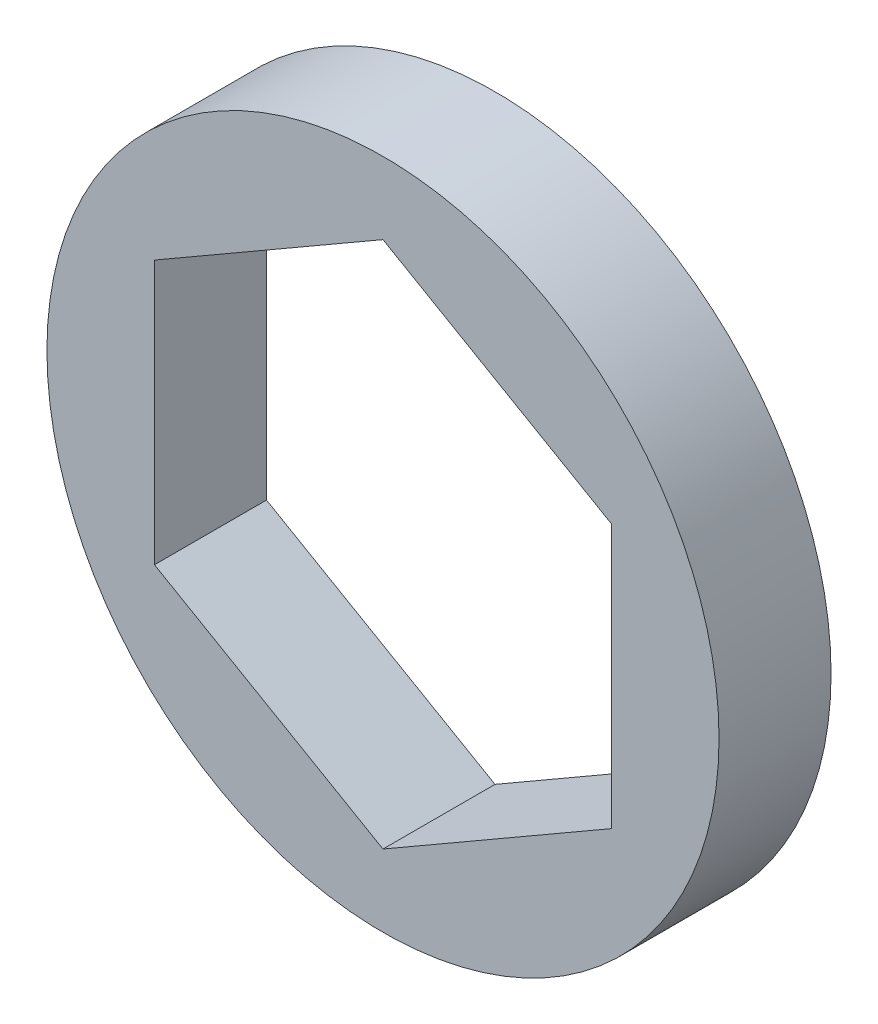
ISO-10303-21;
HEADER;
FILE_DESCRIPTION(('STEP AP214'),'2;1');
FILE_NAME('part.step','',(''),(''),'','','');
FILE_SCHEMA(('AUTOMOTIVE_DESIGN { 1 0 10303 214 1 1 1 1 }'));
ENDSEC;
DATA;
#1=APPLICATION_CONTEXT('core data for automotive mechanical design processes');
#2=APPLICATION_PROTOCOL_DEFINITION('international standard','automotive_design',2000,#1);
#3=PRODUCT_CONTEXT('',#1,'mechanical');
#4=PRODUCT('Part','Part','',(#3));
#5=PRODUCT_RELATED_PRODUCT_CATEGORY('part','',(#4));
#6=PRODUCT_DEFINITION_FORMATION('','',#4);
#7=PRODUCT_DEFINITION_CONTEXT('part definition',#1,'design');
#8=PRODUCT_DEFINITION('design','',#6,#7);
#9=PRODUCT_DEFINITION_SHAPE('','',#8);
#10=(LENGTH_UNIT() NAMED_UNIT(*) SI_UNIT(.MILLI.,.METRE.));
#11=(NAMED_UNIT(*) PLANE_ANGLE_UNIT() SI_UNIT($,.RADIAN.));
#12=(NAMED_UNIT(*) SI_UNIT($,.STERADIAN.) SOLID_ANGLE_UNIT());
#13=UNCERTAINTY_MEASURE_WITH_UNIT(LENGTH_MEASURE(1.E-05),#10,'distance_accuracy_value','');
#14=(GEOMETRIC_REPRESENTATION_CONTEXT(3) GLOBAL_UNCERTAINTY_ASSIGNED_CONTEXT((#13)) GLOBAL_UNIT_ASSIGNED_CONTEXT((#10,
#11,#12)) REPRESENTATION_CONTEXT('',''));
#15=CARTESIAN_POINT('',(0.,0.,0.));
#16=DIRECTION('',(0.,0.,1.));
#17=DIRECTION('',(1.,0.,0.));
#18=AXIS2_PLACEMENT_3D('',#15,#16,#17);
#19=CARTESIAN_POINT('',(0.,0.,-1.5875));
#20=DIRECTION('',(0.,0.,1.));
#21=DIRECTION('',(1.,0.,0.));
#22=AXIS2_PLACEMENT_3D('',#19,#20,#21);
#23=PLANE('',#22);
#24=DIRECTION('',(0.,1.,0.));
#25=VECTOR('',#24,1.);
#26=CARTESIAN_POINT('',(-6.477,3.73949769354121,-1.5875));
#27=LINE('',#26,#25);
#28=CARTESIAN_POINT('',(-6.47700000000001,-3.73949769354121,-1.5875));
#29=VERTEX_POINT('',#28);
#30=CARTESIAN_POINT('',(-6.47700000000001,3.73949769354121,-1.5875));
#31=VERTEX_POINT('',#30);
#32=EDGE_CURVE('E74',#29,#31,#27,.T.);
#33=ORIENTED_EDGE('',*,*,#32,.F.);
#34=DIRECTION('',(-0.866025403784439,0.5,0.));
#35=VECTOR('',#34,1.);
#36=CARTESIAN_POINT('',(-6.47700000000001,-3.73949769354121,-1.5875));
#37=LINE('',#36,#35);
#38=CARTESIAN_POINT('',(0.,-7.47899538708242,-1.5875));
#39=VERTEX_POINT('',#38);
#40=EDGE_CURVE('E104',#39,#29,#37,.T.);
#41=ORIENTED_EDGE('',*,*,#40,.F.);
#42=DIRECTION('',(-0.866025403784439,-0.5,0.));
#43=VECTOR('',#42,1.);
#44=CARTESIAN_POINT('',(0.,-7.47899538708242,-1.5875));
#45=LINE('',#44,#43);
#46=CARTESIAN_POINT('',(6.47700000000001,-3.73949769354122,-1.5875));
#47=VERTEX_POINT('',#46);
#48=EDGE_CURVE('E112',#47,#39,#45,.T.);
#49=ORIENTED_EDGE('',*,*,#48,.F.);
#50=DIRECTION('',(0.,-1.,0.));
#51=VECTOR('',#50,1.);
#52=CARTESIAN_POINT('',(6.47700000000001,-3.73949769354122,-1.5875));
#53=LINE('',#52,#51);
#54=CARTESIAN_POINT('',(6.47700000000001,3.73949769354121,-1.5875));
#55=VERTEX_POINT('',#54);
#56=EDGE_CURVE('E117',#55,#47,#53,.T.);
#57=ORIENTED_EDGE('',*,*,#56,.F.);
#58=DIRECTION('',(0.866025403784438,-0.500000000000001,0.));
#59=VECTOR('',#58,1.);
#60=CARTESIAN_POINT('',(6.47700000000001,3.73949769354121,-1.5875));
#61=LINE('',#60,#59);
#62=CARTESIAN_POINT('',(0.,7.47899538708242,-1.5875));
#63=VERTEX_POINT('',#62);
#64=EDGE_CURVE('E69',#63,#55,#61,.T.);
#65=ORIENTED_EDGE('',*,*,#64,.F.);
#66=DIRECTION('',(0.866025403784439,0.5,0.));
#67=VECTOR('',#66,1.);
#68=CARTESIAN_POINT('',(0.,7.47899538708242,-1.5875));
#69=LINE('',#68,#67);
#70=EDGE_CURVE('E71',#31,#63,#69,.T.);
#71=ORIENTED_EDGE('',*,*,#70,.F.);
#72=EDGE_LOOP('',(#33,#41,#49,#57,#65,#71));
#73=FACE_BOUND('',#72,.T.);
#74=CARTESIAN_POINT('',(0.,0.,-1.5875));
#75=DIRECTION('',(0.,0.,-1.));
#76=DIRECTION('',(-1.,0.,0.));
#77=AXIS2_PLACEMENT_3D('',#74,#75,#76);
#78=CIRCLE('',#77,9.525);
#79=CARTESIAN_POINT('',(-9.525,0.,-1.5875));
#80=VERTEX_POINT('',#79);
#81=EDGE_CURVE('E21',#80,#80,#78,.F.);
#82=ORIENTED_EDGE('',*,*,#81,.F.);
#83=EDGE_LOOP('',(#82));
#84=FACE_BOUND('',#83,.T.);
#85=ADVANCED_FACE('F18',(#73,#84),#23,.F.);
#86=CARTESIAN_POINT('',(0.,0.,1.5875));
#87=DIRECTION('',(0.,0.,-1.));
#88=DIRECTION('',(-1.,0.,0.));
#89=AXIS2_PLACEMENT_3D('',#86,#87,#88);
#90=CYLINDRICAL_SURFACE('',#89,9.525);
#91=ORIENTED_EDGE('',*,*,#81,.T.);
#92=EDGE_LOOP('',(#91));
#93=FACE_BOUND('',#92,.T.);
#94=CARTESIAN_POINT('',(0.,0.,1.5875));
#95=DIRECTION('',(0.,0.,-1.));
#96=DIRECTION('',(-1.,0.,0.));
#97=AXIS2_PLACEMENT_3D('',#94,#95,#96);
#98=CIRCLE('',#97,9.525);
#99=CARTESIAN_POINT('',(-9.525,0.,1.5875));
#100=VERTEX_POINT('',#99);
#101=EDGE_CURVE('E96',#100,#100,#98,.F.);
#102=ORIENTED_EDGE('',*,*,#101,.F.);
#103=EDGE_LOOP('',(#102));
#104=FACE_BOUND('',#103,.T.);
#105=ADVANCED_FACE('F154',(#93,#104),#90,.T.);
#106=CARTESIAN_POINT('',(-6.477,3.73949769354121,1.5875));
#107=DIRECTION('',(1.,0.,0.));
#108=DIRECTION('',(0.,1.,0.));
#109=AXIS2_PLACEMENT_3D('',#106,#107,#108);
#110=PLANE('',#109);
#111=DIRECTION('',(0.,1.,0.));
#112=VECTOR('',#111,1.);
#113=CARTESIAN_POINT('',(-6.47700000000001,0.,1.5875));
#114=LINE('',#113,#112);
#115=CARTESIAN_POINT('',(-6.47700000000001,-3.73949769354121,1.5875));
#116=VERTEX_POINT('',#115);
#117=CARTESIAN_POINT('',(-6.47700000000001,3.73949769354121,1.5875));
#118=VERTEX_POINT('',#117);
#119=EDGE_CURVE('E98',#116,#118,#114,.T.);
#120=ORIENTED_EDGE('',*,*,#119,.F.);
#121=DIRECTION('',(0.,0.,1.));
#122=VECTOR('',#121,1.);
#123=CARTESIAN_POINT('',(-6.47700000000001,-3.73949769354121,1.5875));
#124=LINE('',#123,#122);
#125=EDGE_CURVE('E85',#29,#116,#124,.T.);
#126=ORIENTED_EDGE('',*,*,#125,.F.);
#127=ORIENTED_EDGE('',*,*,#32,.T.);
#128=DIRECTION('',(0.,0.,1.));
#129=VECTOR('',#128,1.);
#130=CARTESIAN_POINT('',(-6.477,3.73949769354121,1.5875));
#131=LINE('',#130,#129);
#132=EDGE_CURVE('E79',#118,#31,#131,.F.);
#133=ORIENTED_EDGE('',*,*,#132,.F.);
#134=EDGE_LOOP('',(#120,#126,#127,#133));
#135=FACE_BOUND('',#134,.T.);
#136=ADVANCED_FACE('F82',(#135),#110,.T.);
#137=CARTESIAN_POINT('',(0.,7.47899538708242,1.5875));
#138=DIRECTION('',(0.5,-0.866025403784439,0.));
#139=DIRECTION('',(0.866025403784439,0.5,0.));
#140=AXIS2_PLACEMENT_3D('',#137,#138,#139);
#141=PLANE('',#140);
#142=DIRECTION('',(0.866025403784439,0.5,0.));
#143=VECTOR('',#142,1.);
#144=CARTESIAN_POINT('',(-6.477,3.73949769354121,1.5875));
#145=LINE('',#144,#143);
#146=CARTESIAN_POINT('',(0.,7.47899538708242,1.5875));
#147=VERTEX_POINT('',#146);
#148=EDGE_CURVE('E90',#118,#147,#145,.T.);
#149=ORIENTED_EDGE('',*,*,#148,.F.);
#150=ORIENTED_EDGE('',*,*,#132,.T.);
#151=ORIENTED_EDGE('',*,*,#70,.T.);
#152=DIRECTION('',(0.,0.,1.));
#153=VECTOR('',#152,1.);
#154=CARTESIAN_POINT('',(0.,7.47899538708242,1.5875));
#155=LINE('',#154,#153);
#156=EDGE_CURVE('E93',#147,#63,#155,.F.);
#157=ORIENTED_EDGE('',*,*,#156,.F.);
#158=EDGE_LOOP('',(#149,#150,#151,#157));
#159=FACE_BOUND('',#158,.T.);
#160=ADVANCED_FACE('F88',(#159),#141,.T.);
#161=CARTESIAN_POINT('',(6.47700000000001,3.73949769354121,1.5875));
#162=DIRECTION('',(-0.500000000000001,-0.866025403784438,0.));
#163=DIRECTION('',(0.866025403784438,-0.500000000000001,0.));
#164=AXIS2_PLACEMENT_3D('',#161,#162,#163);
#165=PLANE('',#164);
#166=DIRECTION('',(0.866025403784438,-0.5,0.));
#167=VECTOR('',#166,1.);
#168=CARTESIAN_POINT('',(0.,7.47899538708242,1.5875));
#169=LINE('',#168,#167);
#170=CARTESIAN_POINT('',(6.47700000000001,3.73949769354121,1.5875));
#171=VERTEX_POINT('',#170);
#172=EDGE_CURVE('E123',#147,#171,#169,.T.);
#173=ORIENTED_EDGE('',*,*,#172,.F.);
#174=ORIENTED_EDGE('',*,*,#156,.T.);
#175=ORIENTED_EDGE('',*,*,#64,.T.);
#176=DIRECTION('',(0.,0.,1.));
#177=VECTOR('',#176,1.);
#178=CARTESIAN_POINT('',(6.47700000000001,3.73949769354121,1.5875));
#179=LINE('',#178,#177);
#180=EDGE_CURVE('E114',#171,#55,#179,.F.);
#181=ORIENTED_EDGE('',*,*,#180,.F.);
#182=EDGE_LOOP('',(#173,#174,#175,#181));
#183=FACE_BOUND('',#182,.T.);
#184=ADVANCED_FACE('F121',(#183),#165,.T.);
#185=CARTESIAN_POINT('',(6.47700000000001,-3.73949769354122,1.5875));
#186=DIRECTION('',(-1.,0.,0.));
#187=DIRECTION('',(0.,-1.,0.));
#188=AXIS2_PLACEMENT_3D('',#185,#186,#187);
#189=PLANE('',#188);
#190=DIRECTION('',(0.,1.,0.));
#191=VECTOR('',#190,1.);
#192=CARTESIAN_POINT('',(6.47700000000001,0.,1.5875));
#193=LINE('',#192,#191);
#194=CARTESIAN_POINT('',(6.47700000000001,-3.73949769354122,1.5875));
#195=VERTEX_POINT('',#194);
#196=EDGE_CURVE('E127',#171,#195,#193,.F.);
#197=ORIENTED_EDGE('',*,*,#196,.F.);
#198=ORIENTED_EDGE('',*,*,#180,.T.);
#199=ORIENTED_EDGE('',*,*,#56,.T.);
#200=DIRECTION('',(0.,0.,1.));
#201=VECTOR('',#200,1.);
#202=CARTESIAN_POINT('',(6.477,-3.73949769354122,1.5875));
#203=LINE('',#202,#201);
#204=EDGE_CURVE('E109',#195,#47,#203,.F.);
#205=ORIENTED_EDGE('',*,*,#204,.F.);
#206=EDGE_LOOP('',(#197,#198,#199,#205));
#207=FACE_BOUND('',#206,.T.);
#208=ADVANCED_FACE('F135',(#207),#189,.T.);
#209=CARTESIAN_POINT('',(0.,-7.47899538708242,1.5875));
#210=DIRECTION('',(-0.5,0.866025403784439,0.));
#211=DIRECTION('',(-0.866025403784439,-0.5,0.));
#212=AXIS2_PLACEMENT_3D('',#209,#210,#211);
#213=PLANE('',#212);
#214=DIRECTION('',(-0.866025403784439,-0.5,0.));
#215=VECTOR('',#214,1.);
#216=CARTESIAN_POINT('',(6.47700000000001,-3.73949769354122,1.5875));
#217=LINE('',#216,#215);
#218=CARTESIAN_POINT('',(0.,-7.47899538708242,1.5875));
#219=VERTEX_POINT('',#218);
#220=EDGE_CURVE('E27',#195,#219,#217,.T.);
#221=ORIENTED_EDGE('',*,*,#220,.F.);
#222=ORIENTED_EDGE('',*,*,#204,.T.);
#223=ORIENTED_EDGE('',*,*,#48,.T.);
#224=DIRECTION('',(0.,0.,1.));
#225=VECTOR('',#224,1.);
#226=CARTESIAN_POINT('',(0.,-7.47899538708242,1.5875));
#227=LINE('',#226,#225);
#228=EDGE_CURVE('E36',#219,#39,#227,.F.);
#229=ORIENTED_EDGE('',*,*,#228,.F.);
#230=EDGE_LOOP('',(#221,#222,#223,#229));
#231=FACE_BOUND('',#230,.T.);
#232=ADVANCED_FACE('F133',(#231),#213,.T.);
#233=CARTESIAN_POINT('',(-6.47700000000001,-3.73949769354121,1.5875));
#234=DIRECTION('',(0.5,0.866025403784439,0.));
#235=DIRECTION('',(-0.866025403784439,0.5,0.));
#236=AXIS2_PLACEMENT_3D('',#233,#234,#235);
#237=PLANE('',#236);
#238=DIRECTION('',(-0.866025403784438,0.5,0.));
#239=VECTOR('',#238,1.);
#240=CARTESIAN_POINT('',(0.,-7.47899538708242,1.5875));
#241=LINE('',#240,#239);
#242=EDGE_CURVE('E11',#219,#116,#241,.T.);
#243=ORIENTED_EDGE('',*,*,#242,.F.);
#244=ORIENTED_EDGE('',*,*,#228,.T.);
#245=ORIENTED_EDGE('',*,*,#40,.T.);
#246=ORIENTED_EDGE('',*,*,#125,.T.);
#247=EDGE_LOOP('',(#243,#244,#245,#246));
#248=FACE_BOUND('',#247,.T.);
#249=ADVANCED_FACE('F136',(#248),#237,.T.);
#250=CARTESIAN_POINT('',(0.,0.,1.5875));
#251=DIRECTION('',(0.,0.,1.));
#252=DIRECTION('',(1.,0.,0.));
#253=AXIS2_PLACEMENT_3D('',#250,#251,#252);
#254=PLANE('',#253);
#255=ORIENTED_EDGE('',*,*,#220,.T.);
#256=ORIENTED_EDGE('',*,*,#242,.T.);
#257=ORIENTED_EDGE('',*,*,#119,.T.);
#258=ORIENTED_EDGE('',*,*,#148,.T.);
#259=ORIENTED_EDGE('',*,*,#172,.T.);
#260=ORIENTED_EDGE('',*,*,#196,.T.);
#261=EDGE_LOOP('',(#255,#256,#257,#258,#259,#260));
#262=FACE_BOUND('',#261,.T.);
#263=ORIENTED_EDGE('',*,*,#101,.T.);
#264=EDGE_LOOP('',(#263));
#265=FACE_BOUND('',#264,.T.);
#266=ADVANCED_FACE('F130',(#262,#265),#254,.T.);
#267=CLOSED_SHELL('',(#85,#105,#136,#160,#184,#208,#232,#249,#266));
#268=MANIFOLD_SOLID_BREP('B1',#267);
#269=ADVANCED_BREP_SHAPE_REPRESENTATION('',(#18,#268),#14);
#270=SHAPE_DEFINITION_REPRESENTATION(#9,#269);
ENDSEC;
END-ISO-10303-21;
